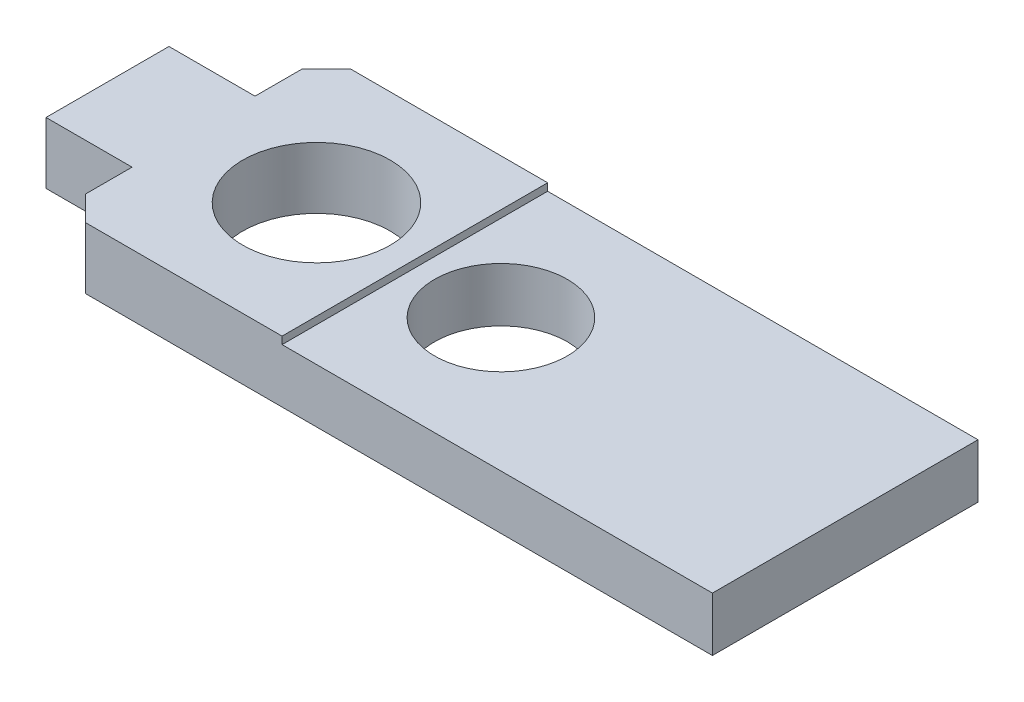
ISO-10303-21;
HEADER;
FILE_DESCRIPTION(('STEP AP214'),'2;1');
FILE_NAME('part.step','',(''),(''),'','','');
FILE_SCHEMA(('AUTOMOTIVE_DESIGN { 1 0 10303 214 1 1 1 1 }'));
ENDSEC;
DATA;
#1=APPLICATION_CONTEXT('core data for automotive mechanical design processes');
#2=APPLICATION_PROTOCOL_DEFINITION('international standard','automotive_design',2000,#1);
#3=PRODUCT_CONTEXT('',#1,'mechanical');
#4=PRODUCT('Part','Part','',(#3));
#5=PRODUCT_RELATED_PRODUCT_CATEGORY('part','',(#4));
#6=PRODUCT_DEFINITION_FORMATION('','',#4);
#7=PRODUCT_DEFINITION_CONTEXT('part definition',#1,'design');
#8=PRODUCT_DEFINITION('design','',#6,#7);
#9=PRODUCT_DEFINITION_SHAPE('','',#8);
#10=(LENGTH_UNIT() NAMED_UNIT(*) SI_UNIT(.MILLI.,.METRE.));
#11=(NAMED_UNIT(*) PLANE_ANGLE_UNIT() SI_UNIT($,.RADIAN.));
#12=(NAMED_UNIT(*) SI_UNIT($,.STERADIAN.) SOLID_ANGLE_UNIT());
#13=UNCERTAINTY_MEASURE_WITH_UNIT(LENGTH_MEASURE(1.E-05),#10,'distance_accuracy_value','');
#14=(GEOMETRIC_REPRESENTATION_CONTEXT(3) GLOBAL_UNCERTAINTY_ASSIGNED_CONTEXT((#13)) GLOBAL_UNIT_ASSIGNED_CONTEXT((#10,
#11,#12)) REPRESENTATION_CONTEXT('',''));
#15=CARTESIAN_POINT('',(0.,0.,0.));
#16=DIRECTION('',(0.,0.,1.));
#17=DIRECTION('',(1.,0.,0.));
#18=AXIS2_PLACEMENT_3D('',#15,#16,#17);
#19=CARTESIAN_POINT('',(-25.,25.,0.));
#20=DIRECTION('',(1.,0.,0.));
#21=DIRECTION('',(0.,0.,-1.));
#22=AXIS2_PLACEMENT_3D('',#19,#20,#21);
#23=PLANE('',#22);
#24=DIRECTION('',(0.,1.,0.));
#25=VECTOR('',#24,1.);
#26=CARTESIAN_POINT('',(-25.,0.,-54.));
#27=LINE('',#26,#25);
#28=CARTESIAN_POINT('',(-25.,25.,-54.));
#29=VERTEX_POINT('',#28);
#30=CARTESIAN_POINT('',(-25.,22.,-54.));
#31=VERTEX_POINT('',#30);
#32=EDGE_CURVE('E148',#29,#31,#27,.F.);
#33=ORIENTED_EDGE('',*,*,#32,.F.);
#34=DIRECTION('',(0.,0.,1.));
#35=VECTOR('',#34,1.);
#36=CARTESIAN_POINT('',(-25.,25.,0.));
#37=LINE('',#36,#35);
#38=CARTESIAN_POINT('',(-25.,25.,54.));
#39=VERTEX_POINT('',#38);
#40=EDGE_CURVE('E127',#39,#29,#37,.F.);
#41=ORIENTED_EDGE('',*,*,#40,.F.);
#42=DIRECTION('',(0.,1.,0.));
#43=VECTOR('',#42,1.);
#44=CARTESIAN_POINT('',(-25.,0.,54.));
#45=LINE('',#44,#43);
#46=CARTESIAN_POINT('',(-25.,22.,54.));
#47=VERTEX_POINT('',#46);
#48=EDGE_CURVE('E168',#47,#39,#45,.T.);
#49=ORIENTED_EDGE('',*,*,#48,.F.);
#50=DIRECTION('',(0.,0.,-1.));
#51=VECTOR('',#50,1.);
#52=CARTESIAN_POINT('',(-25.,22.,54.));
#53=LINE('',#52,#51);
#54=EDGE_CURVE('E137',#47,#31,#53,.T.);
#55=ORIENTED_EDGE('',*,*,#54,.T.);
#56=EDGE_LOOP('',(#33,#41,#49,#55));
#57=FACE_BOUND('',#56,.T.);
#58=ADVANCED_FACE('F17',(#57),#23,.T.);
#59=CARTESIAN_POINT('',(150.,22.,54.));
#60=DIRECTION('',(0.,-1.,0.));
#61=DIRECTION('',(0.,0.,-1.));
#62=AXIS2_PLACEMENT_3D('',#59,#60,#61);
#63=PLANE('',#62);
#64=CARTESIAN_POINT('',(10.,22.,0.));
#65=DIRECTION('',(0.,-1.,0.));
#66=DIRECTION('',(0.,0.,-1.));
#67=AXIS2_PLACEMENT_3D('',#64,#65,#66);
#68=CIRCLE('',#67,27.);
#69=CARTESIAN_POINT('',(10.,22.,-27.));
#70=VERTEX_POINT('',#69);
#71=EDGE_CURVE('E20',#70,#70,#68,.T.);
#72=ORIENTED_EDGE('',*,*,#71,.T.);
#73=EDGE_LOOP('',(#72));
#74=FACE_BOUND('',#73,.T.);
#75=DIRECTION('',(-1.,0.,0.));
#76=VECTOR('',#75,1.);
#77=CARTESIAN_POINT('',(150.,22.,-54.));
#78=LINE('',#77,#76);
#79=CARTESIAN_POINT('',(150.,22.,-54.));
#80=VERTEX_POINT('',#79);
#81=EDGE_CURVE('E161',#31,#80,#78,.F.);
#82=ORIENTED_EDGE('',*,*,#81,.F.);
#83=ORIENTED_EDGE('',*,*,#54,.F.);
#84=DIRECTION('',(1.,0.,0.));
#85=VECTOR('',#84,1.);
#86=CARTESIAN_POINT('',(-115.,22.,54.));
#87=LINE('',#86,#85);
#88=CARTESIAN_POINT('',(150.,22.,54.));
#89=VERTEX_POINT('',#88);
#90=EDGE_CURVE('E171',#89,#47,#87,.F.);
#91=ORIENTED_EDGE('',*,*,#90,.F.);
#92=DIRECTION('',(0.,0.,-1.));
#93=VECTOR('',#92,1.);
#94=CARTESIAN_POINT('',(150.,22.,54.));
#95=LINE('',#94,#93);
#96=EDGE_CURVE('E163',#80,#89,#95,.F.);
#97=ORIENTED_EDGE('',*,*,#96,.F.);
#98=EDGE_LOOP('',(#82,#83,#91,#97));
#99=FACE_BOUND('',#98,.T.);
#100=ADVANCED_FACE('F251',(#74,#99),#63,.F.);
#101=CARTESIAN_POINT('',(0.,25.,0.));
#102=DIRECTION('',(0.,1.,0.));
#103=DIRECTION('',(0.,0.,1.));
#104=AXIS2_PLACEMENT_3D('',#101,#102,#103);
#105=PLANE('',#104);
#106=CARTESIAN_POINT('',(-65.,25.,0.));
#107=DIRECTION('',(0.,-1.,0.));
#108=DIRECTION('',(0.,0.,-1.));
#109=AXIS2_PLACEMENT_3D('',#106,#107,#108);
#110=CIRCLE('',#109,30.);
#111=CARTESIAN_POINT('',(-65.,25.,-30.));
#112=VERTEX_POINT('',#111);
#113=EDGE_CURVE('E141',#112,#112,#110,.T.);
#114=ORIENTED_EDGE('',*,*,#113,.T.);
#115=EDGE_LOOP('',(#114));
#116=FACE_BOUND('',#115,.T.);
#117=DIRECTION('',(1.,0.,0.));
#118=VECTOR('',#117,1.);
#119=CARTESIAN_POINT('',(-115.,25.,54.));
#120=LINE('',#119,#118);
#121=CARTESIAN_POINT('',(-105.,25.,54.));
#122=VERTEX_POINT('',#121);
#123=EDGE_CURVE('E176',#39,#122,#120,.F.);
#124=ORIENTED_EDGE('',*,*,#123,.F.);
#125=ORIENTED_EDGE('',*,*,#40,.T.);
#126=DIRECTION('',(-1.,0.,0.));
#127=VECTOR('',#126,1.);
#128=CARTESIAN_POINT('',(150.,25.,-54.));
#129=LINE('',#128,#127);
#130=CARTESIAN_POINT('',(-105.,25.,-54.));
#131=VERTEX_POINT('',#130);
#132=EDGE_CURVE('E123',#131,#29,#129,.F.);
#133=ORIENTED_EDGE('',*,*,#132,.F.);
#134=DIRECTION('',(-0.707106781186548,0.,0.707106781186548));
#135=VECTOR('',#134,1.);
#136=CARTESIAN_POINT('',(-110.,25.,-49.));
#137=LINE('',#136,#135);
#138=CARTESIAN_POINT('',(-115.,25.,-44.));
#139=VERTEX_POINT('',#138);
#140=EDGE_CURVE('E117',#139,#131,#137,.F.);
#141=ORIENTED_EDGE('',*,*,#140,.F.);
#142=DIRECTION('',(0.,0.,1.));
#143=VECTOR('',#142,1.);
#144=CARTESIAN_POINT('',(-115.,25.,-54.));
#145=LINE('',#144,#143);
#146=CARTESIAN_POINT('',(-115.,25.,-25.));
#147=VERTEX_POINT('',#146);
#148=EDGE_CURVE('E108',#147,#139,#145,.F.);
#149=ORIENTED_EDGE('',*,*,#148,.F.);
#150=DIRECTION('',(-1.,0.,0.));
#151=VECTOR('',#150,1.);
#152=CARTESIAN_POINT('',(-115.,25.,-25.));
#153=LINE('',#152,#151);
#154=CARTESIAN_POINT('',(-150.,25.,-25.));
#155=VERTEX_POINT('',#154);
#156=EDGE_CURVE('E103',#155,#147,#153,.F.);
#157=ORIENTED_EDGE('',*,*,#156,.F.);
#158=DIRECTION('',(0.,0.,1.));
#159=VECTOR('',#158,1.);
#160=CARTESIAN_POINT('',(-150.,25.,-25.));
#161=LINE('',#160,#159);
#162=CARTESIAN_POINT('',(-150.,25.,25.));
#163=VERTEX_POINT('',#162);
#164=EDGE_CURVE('E192',#163,#155,#161,.F.);
#165=ORIENTED_EDGE('',*,*,#164,.F.);
#166=DIRECTION('',(1.,0.,0.));
#167=VECTOR('',#166,1.);
#168=CARTESIAN_POINT('',(-150.,25.,25.));
#169=LINE('',#168,#167);
#170=CARTESIAN_POINT('',(-115.,25.,25.));
#171=VERTEX_POINT('',#170);
#172=EDGE_CURVE('E188',#171,#163,#169,.F.);
#173=ORIENTED_EDGE('',*,*,#172,.F.);
#174=DIRECTION('',(0.,0.,1.));
#175=VECTOR('',#174,1.);
#176=CARTESIAN_POINT('',(-115.,25.,25.));
#177=LINE('',#176,#175);
#178=CARTESIAN_POINT('',(-115.,25.,44.));
#179=VERTEX_POINT('',#178);
#180=EDGE_CURVE('E184',#179,#171,#177,.F.);
#181=ORIENTED_EDGE('',*,*,#180,.F.);
#182=DIRECTION('',(0.707106781186548,0.,0.707106781186548));
#183=VECTOR('',#182,1.);
#184=CARTESIAN_POINT('',(-110.,25.,49.));
#185=LINE('',#184,#183);
#186=EDGE_CURVE('E180',#122,#179,#185,.F.);
#187=ORIENTED_EDGE('',*,*,#186,.F.);
#188=EDGE_LOOP('',(#124,#125,#133,#141,#149,#157,#165,#173,#181,#187));
#189=FACE_BOUND('',#188,.T.);
#190=ADVANCED_FACE('F121',(#116,#189),#105,.T.);
#191=CARTESIAN_POINT('',(-110.,12.5,-49.));
#192=DIRECTION('',(-0.707106781186548,0.,-0.707106781186548));
#193=DIRECTION('',(-0.707106781186548,0.,0.707106781186548));
#194=AXIS2_PLACEMENT_3D('',#191,#192,#193);
#195=PLANE('',#194);
#196=DIRECTION('',(0.,1.,0.));
#197=VECTOR('',#196,1.);
#198=CARTESIAN_POINT('',(-105.,0.,-54.));
#199=LINE('',#198,#197);
#200=CARTESIAN_POINT('',(-105.,0.,-54.));
#201=VERTEX_POINT('',#200);
#202=EDGE_CURVE('E155',#201,#131,#199,.T.);
#203=ORIENTED_EDGE('',*,*,#202,.F.);
#204=DIRECTION('',(-0.707106781186548,0.,0.707106781186547));
#205=VECTOR('',#204,1.);
#206=CARTESIAN_POINT('',(-105.,0.,-54.));
#207=LINE('',#206,#205);
#208=CARTESIAN_POINT('',(-115.,0.,-44.));
#209=VERTEX_POINT('',#208);
#210=EDGE_CURVE('E131',#201,#209,#207,.T.);
#211=ORIENTED_EDGE('',*,*,#210,.T.);
#212=DIRECTION('',(0.,1.,0.));
#213=VECTOR('',#212,1.);
#214=CARTESIAN_POINT('',(-115.,0.,-44.));
#215=LINE('',#214,#213);
#216=EDGE_CURVE('E113',#139,#209,#215,.F.);
#217=ORIENTED_EDGE('',*,*,#216,.F.);
#218=ORIENTED_EDGE('',*,*,#140,.T.);
#219=EDGE_LOOP('',(#203,#211,#217,#218));
#220=FACE_BOUND('',#219,.T.);
#221=ADVANCED_FACE('F130',(#220),#195,.T.);
#222=CARTESIAN_POINT('',(-115.,0.,-54.));
#223=DIRECTION('',(-1.,0.,0.));
#224=DIRECTION('',(0.,0.,1.));
#225=AXIS2_PLACEMENT_3D('',#222,#223,#224);
#226=PLANE('',#225);
#227=ORIENTED_EDGE('',*,*,#148,.T.);
#228=ORIENTED_EDGE('',*,*,#216,.T.);
#229=DIRECTION('',(0.,0.,1.));
#230=VECTOR('',#229,1.);
#231=CARTESIAN_POINT('',(-115.,0.,0.));
#232=LINE('',#231,#230);
#233=CARTESIAN_POINT('',(-115.,0.,-25.));
#234=VERTEX_POINT('',#233);
#235=EDGE_CURVE('E145',#209,#234,#232,.T.);
#236=ORIENTED_EDGE('',*,*,#235,.T.);
#237=DIRECTION('',(0.,1.,0.));
#238=VECTOR('',#237,1.);
#239=CARTESIAN_POINT('',(-115.,0.,-25.));
#240=LINE('',#239,#238);
#241=EDGE_CURVE('E115',#147,#234,#240,.F.);
#242=ORIENTED_EDGE('',*,*,#241,.F.);
#243=EDGE_LOOP('',(#227,#228,#236,#242));
#244=FACE_BOUND('',#243,.T.);
#245=ADVANCED_FACE('F110',(#244),#226,.T.);
#246=CARTESIAN_POINT('',(-115.,0.,-25.));
#247=DIRECTION('',(0.,0.,-1.));
#248=DIRECTION('',(-1.,0.,0.));
#249=AXIS2_PLACEMENT_3D('',#246,#247,#248);
#250=PLANE('',#249);
#251=ORIENTED_EDGE('',*,*,#241,.T.);
#252=DIRECTION('',(1.,0.,0.));
#253=VECTOR('',#252,1.);
#254=CARTESIAN_POINT('',(0.,0.,-25.));
#255=LINE('',#254,#253);
#256=CARTESIAN_POINT('',(-150.,0.,-25.));
#257=VERTEX_POINT('',#256);
#258=EDGE_CURVE('E196',#234,#257,#255,.F.);
#259=ORIENTED_EDGE('',*,*,#258,.T.);
#260=DIRECTION('',(0.,1.,0.));
#261=VECTOR('',#260,1.);
#262=CARTESIAN_POINT('',(-150.,0.,-25.));
#263=LINE('',#262,#261);
#264=EDGE_CURVE('E190',#155,#257,#263,.F.);
#265=ORIENTED_EDGE('',*,*,#264,.F.);
#266=ORIENTED_EDGE('',*,*,#156,.T.);
#267=EDGE_LOOP('',(#251,#259,#265,#266));
#268=FACE_BOUND('',#267,.T.);
#269=ADVANCED_FACE('F195',(#268),#250,.T.);
#270=CARTESIAN_POINT('',(-150.,0.,-25.));
#271=DIRECTION('',(-1.,0.,0.));
#272=DIRECTION('',(0.,0.,1.));
#273=AXIS2_PLACEMENT_3D('',#270,#271,#272);
#274=PLANE('',#273);
#275=ORIENTED_EDGE('',*,*,#264,.T.);
#276=DIRECTION('',(0.,0.,1.));
#277=VECTOR('',#276,1.);
#278=CARTESIAN_POINT('',(-150.,0.,0.));
#279=LINE('',#278,#277);
#280=CARTESIAN_POINT('',(-150.,0.,25.));
#281=VERTEX_POINT('',#280);
#282=EDGE_CURVE('E203',#257,#281,#279,.T.);
#283=ORIENTED_EDGE('',*,*,#282,.T.);
#284=DIRECTION('',(0.,1.,0.));
#285=VECTOR('',#284,1.);
#286=CARTESIAN_POINT('',(-150.,0.,25.));
#287=LINE('',#286,#285);
#288=EDGE_CURVE('E186',#163,#281,#287,.F.);
#289=ORIENTED_EDGE('',*,*,#288,.F.);
#290=ORIENTED_EDGE('',*,*,#164,.T.);
#291=EDGE_LOOP('',(#275,#283,#289,#290));
#292=FACE_BOUND('',#291,.T.);
#293=ADVANCED_FACE('F248',(#292),#274,.T.);
#294=CARTESIAN_POINT('',(-150.,0.,25.));
#295=DIRECTION('',(0.,0.,1.));
#296=DIRECTION('',(1.,0.,0.));
#297=AXIS2_PLACEMENT_3D('',#294,#295,#296);
#298=PLANE('',#297);
#299=ORIENTED_EDGE('',*,*,#288,.T.);
#300=DIRECTION('',(1.,0.,0.));
#301=VECTOR('',#300,1.);
#302=CARTESIAN_POINT('',(0.,0.,25.));
#303=LINE('',#302,#301);
#304=CARTESIAN_POINT('',(-115.,0.,25.));
#305=VERTEX_POINT('',#304);
#306=EDGE_CURVE('E207',#281,#305,#303,.T.);
#307=ORIENTED_EDGE('',*,*,#306,.T.);
#308=DIRECTION('',(0.,1.,0.));
#309=VECTOR('',#308,1.);
#310=CARTESIAN_POINT('',(-115.,0.,25.));
#311=LINE('',#310,#309);
#312=EDGE_CURVE('E182',#171,#305,#311,.F.);
#313=ORIENTED_EDGE('',*,*,#312,.F.);
#314=ORIENTED_EDGE('',*,*,#172,.T.);
#315=EDGE_LOOP('',(#299,#307,#313,#314));
#316=FACE_BOUND('',#315,.T.);
#317=ADVANCED_FACE('F244',(#316),#298,.T.);
#318=CARTESIAN_POINT('',(-115.,0.,25.));
#319=DIRECTION('',(-1.,0.,0.));
#320=DIRECTION('',(0.,0.,1.));
#321=AXIS2_PLACEMENT_3D('',#318,#319,#320);
#322=PLANE('',#321);
#323=DIRECTION('',(0.,0.,1.));
#324=VECTOR('',#323,1.);
#325=CARTESIAN_POINT('',(-115.,0.,0.));
#326=LINE('',#325,#324);
#327=CARTESIAN_POINT('',(-115.,0.,44.));
#328=VERTEX_POINT('',#327);
#329=EDGE_CURVE('E210',#305,#328,#326,.T.);
#330=ORIENTED_EDGE('',*,*,#329,.T.);
#331=DIRECTION('',(0.,1.,0.));
#332=VECTOR('',#331,1.);
#333=CARTESIAN_POINT('',(-115.,12.5,44.));
#334=LINE('',#333,#332);
#335=EDGE_CURVE('E178',#179,#328,#334,.F.);
#336=ORIENTED_EDGE('',*,*,#335,.F.);
#337=ORIENTED_EDGE('',*,*,#180,.T.);
#338=ORIENTED_EDGE('',*,*,#312,.T.);
#339=EDGE_LOOP('',(#330,#336,#337,#338));
#340=FACE_BOUND('',#339,.T.);
#341=ADVANCED_FACE('F240',(#340),#322,.T.);
#342=CARTESIAN_POINT('',(-110.,12.5,49.));
#343=DIRECTION('',(-0.707106781186548,0.,0.707106781186548));
#344=DIRECTION('',(0.707106781186548,0.,0.707106781186548));
#345=AXIS2_PLACEMENT_3D('',#342,#343,#344);
#346=PLANE('',#345);
#347=ORIENTED_EDGE('',*,*,#335,.T.);
#348=DIRECTION('',(0.707106781186548,0.,0.707106781186547));
#349=VECTOR('',#348,1.);
#350=CARTESIAN_POINT('',(-115.,0.,44.));
#351=LINE('',#350,#349);
#352=CARTESIAN_POINT('',(-105.,0.,54.));
#353=VERTEX_POINT('',#352);
#354=EDGE_CURVE('E213',#328,#353,#351,.T.);
#355=ORIENTED_EDGE('',*,*,#354,.T.);
#356=DIRECTION('',(0.,1.,0.));
#357=VECTOR('',#356,1.);
#358=CARTESIAN_POINT('',(-105.,0.,54.));
#359=LINE('',#358,#357);
#360=EDGE_CURVE('E174',#122,#353,#359,.F.);
#361=ORIENTED_EDGE('',*,*,#360,.F.);
#362=ORIENTED_EDGE('',*,*,#186,.T.);
#363=EDGE_LOOP('',(#347,#355,#361,#362));
#364=FACE_BOUND('',#363,.T.);
#365=ADVANCED_FACE('F235',(#364),#346,.T.);
#366=CARTESIAN_POINT('',(-115.,0.,54.));
#367=DIRECTION('',(0.,0.,1.));
#368=DIRECTION('',(1.,0.,0.));
#369=AXIS2_PLACEMENT_3D('',#366,#367,#368);
#370=PLANE('',#369);
#371=ORIENTED_EDGE('',*,*,#90,.T.);
#372=ORIENTED_EDGE('',*,*,#48,.T.);
#373=ORIENTED_EDGE('',*,*,#123,.T.);
#374=ORIENTED_EDGE('',*,*,#360,.T.);
#375=DIRECTION('',(1.,0.,0.));
#376=VECTOR('',#375,1.);
#377=CARTESIAN_POINT('',(0.,0.,54.));
#378=LINE('',#377,#376);
#379=CARTESIAN_POINT('',(150.,0.,54.));
#380=VERTEX_POINT('',#379);
#381=EDGE_CURVE('E216',#353,#380,#378,.T.);
#382=ORIENTED_EDGE('',*,*,#381,.T.);
#383=DIRECTION('',(0.,1.,0.));
#384=VECTOR('',#383,1.);
#385=CARTESIAN_POINT('',(150.,0.,54.));
#386=LINE('',#385,#384);
#387=EDGE_CURVE('E166',#89,#380,#386,.F.);
#388=ORIENTED_EDGE('',*,*,#387,.F.);
#389=EDGE_LOOP('',(#371,#372,#373,#374,#382,#388));
#390=FACE_BOUND('',#389,.T.);
#391=ADVANCED_FACE('F229',(#390),#370,.T.);
#392=CARTESIAN_POINT('',(150.,0.,54.));
#393=DIRECTION('',(1.,0.,0.));
#394=DIRECTION('',(0.,0.,-1.));
#395=AXIS2_PLACEMENT_3D('',#392,#393,#394);
#396=PLANE('',#395);
#397=DIRECTION('',(0.,1.,0.));
#398=VECTOR('',#397,1.);
#399=CARTESIAN_POINT('',(150.,0.,-54.));
#400=LINE('',#399,#398);
#401=CARTESIAN_POINT('',(150.,0.,-54.));
#402=VERTEX_POINT('',#401);
#403=EDGE_CURVE('E35',#80,#402,#400,.F.);
#404=ORIENTED_EDGE('',*,*,#403,.F.);
#405=ORIENTED_EDGE('',*,*,#96,.T.);
#406=ORIENTED_EDGE('',*,*,#387,.T.);
#407=DIRECTION('',(0.,0.,1.));
#408=VECTOR('',#407,1.);
#409=CARTESIAN_POINT('',(150.,0.,0.));
#410=LINE('',#409,#408);
#411=EDGE_CURVE('E219',#380,#402,#410,.F.);
#412=ORIENTED_EDGE('',*,*,#411,.T.);
#413=EDGE_LOOP('',(#404,#405,#406,#412));
#414=FACE_BOUND('',#413,.T.);
#415=ADVANCED_FACE('F225',(#414),#396,.T.);
#416=CARTESIAN_POINT('',(150.,0.,-54.));
#417=DIRECTION('',(0.,0.,-1.));
#418=DIRECTION('',(-1.,0.,0.));
#419=AXIS2_PLACEMENT_3D('',#416,#417,#418);
#420=PLANE('',#419);
#421=ORIENTED_EDGE('',*,*,#132,.T.);
#422=ORIENTED_EDGE('',*,*,#32,.T.);
#423=ORIENTED_EDGE('',*,*,#81,.T.);
#424=ORIENTED_EDGE('',*,*,#403,.T.);
#425=DIRECTION('',(1.,0.,0.));
#426=VECTOR('',#425,1.);
#427=CARTESIAN_POINT('',(0.,0.,-54.));
#428=LINE('',#427,#426);
#429=EDGE_CURVE('E140',#402,#201,#428,.F.);
#430=ORIENTED_EDGE('',*,*,#429,.T.);
#431=ORIENTED_EDGE('',*,*,#202,.T.);
#432=EDGE_LOOP('',(#421,#422,#423,#424,#430,#431));
#433=FACE_BOUND('',#432,.T.);
#434=ADVANCED_FACE('F222',(#433),#420,.T.);
#435=CARTESIAN_POINT('',(10.,25.,0.));
#436=DIRECTION('',(0.,-1.,0.));
#437=DIRECTION('',(0.,0.,-1.));
#438=AXIS2_PLACEMENT_3D('',#435,#436,#437);
#439=CYLINDRICAL_SURFACE('',#438,27.);
#440=CARTESIAN_POINT('',(10.,0.,0.));
#441=DIRECTION('',(0.,-1.,0.));
#442=DIRECTION('',(0.,0.,-1.));
#443=AXIS2_PLACEMENT_3D('',#440,#441,#442);
#444=CIRCLE('',#443,27.);
#445=CARTESIAN_POINT('',(10.,0.,-27.));
#446=VERTEX_POINT('',#445);
#447=EDGE_CURVE('E26',#446,#446,#444,.T.);
#448=ORIENTED_EDGE('',*,*,#447,.T.);
#449=EDGE_LOOP('',(#448));
#450=FACE_BOUND('',#449,.T.);
#451=ORIENTED_EDGE('',*,*,#71,.F.);
#452=EDGE_LOOP('',(#451));
#453=FACE_BOUND('',#452,.T.);
#454=ADVANCED_FACE('F266',(#450,#453),#439,.F.);
#455=CARTESIAN_POINT('',(-65.,25.,0.));
#456=DIRECTION('',(0.,-1.,0.));
#457=DIRECTION('',(0.,0.,-1.));
#458=AXIS2_PLACEMENT_3D('',#455,#456,#457);
#459=CYLINDRICAL_SURFACE('',#458,30.);
#460=ORIENTED_EDGE('',*,*,#113,.F.);
#461=EDGE_LOOP('',(#460));
#462=FACE_BOUND('',#461,.T.);
#463=CARTESIAN_POINT('',(-65.,0.,0.));
#464=DIRECTION('',(0.,-1.,0.));
#465=DIRECTION('',(0.,0.,-1.));
#466=AXIS2_PLACEMENT_3D('',#463,#464,#465);
#467=CIRCLE('',#466,30.);
#468=CARTESIAN_POINT('',(-65.,0.,-30.));
#469=VERTEX_POINT('',#468);
#470=EDGE_CURVE('E11',#469,#469,#467,.T.);
#471=ORIENTED_EDGE('',*,*,#470,.T.);
#472=EDGE_LOOP('',(#471));
#473=FACE_BOUND('',#472,.T.);
#474=ADVANCED_FACE('F260',(#462,#473),#459,.F.);
#475=CARTESIAN_POINT('',(0.,0.,0.));
#476=DIRECTION('',(0.,1.,0.));
#477=DIRECTION('',(0.,0.,1.));
#478=AXIS2_PLACEMENT_3D('',#475,#476,#477);
#479=PLANE('',#478);
#480=ORIENTED_EDGE('',*,*,#470,.F.);
#481=EDGE_LOOP('',(#480));
#482=FACE_BOUND('',#481,.T.);
#483=ORIENTED_EDGE('',*,*,#447,.F.);
#484=EDGE_LOOP('',(#483));
#485=FACE_BOUND('',#484,.T.);
#486=ORIENTED_EDGE('',*,*,#411,.F.);
#487=ORIENTED_EDGE('',*,*,#381,.F.);
#488=ORIENTED_EDGE('',*,*,#354,.F.);
#489=ORIENTED_EDGE('',*,*,#329,.F.);
#490=ORIENTED_EDGE('',*,*,#306,.F.);
#491=ORIENTED_EDGE('',*,*,#282,.F.);
#492=ORIENTED_EDGE('',*,*,#258,.F.);
#493=ORIENTED_EDGE('',*,*,#235,.F.);
#494=ORIENTED_EDGE('',*,*,#210,.F.);
#495=ORIENTED_EDGE('',*,*,#429,.F.);
#496=EDGE_LOOP('',(#486,#487,#488,#489,#490,#491,#492,#493,#494,#495));
#497=FACE_BOUND('',#496,.T.);
#498=ADVANCED_FACE('F200',(#482,#485,#497),#479,.F.);
#499=CLOSED_SHELL('',(#58,#100,#190,#221,#245,#269,#293,#317,#341,#365,#391,#415,#434,#454,#474,#498));
#500=MANIFOLD_SOLID_BREP('B1',#499);
#501=ADVANCED_BREP_SHAPE_REPRESENTATION('',(#18,#500),#14);
#502=SHAPE_DEFINITION_REPRESENTATION(#9,#501);
ENDSEC;
END-ISO-10303-21;
